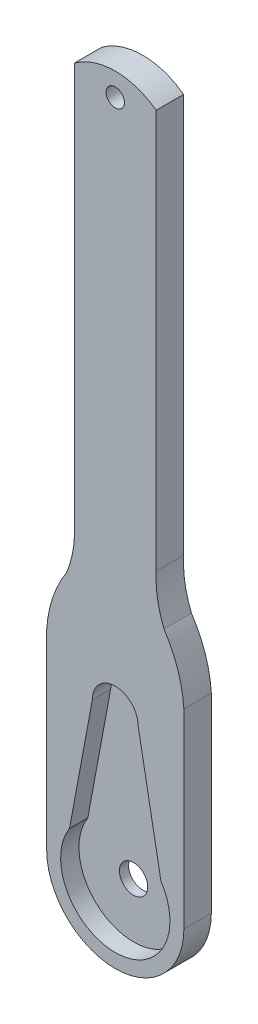
ISO-10303-21;
HEADER;
FILE_DESCRIPTION(('STEP AP214'),'2;1');
FILE_NAME('part.step','',(''),(''),'','','');
FILE_SCHEMA(('AUTOMOTIVE_DESIGN { 1 0 10303 214 1 1 1 1 }'));
ENDSEC;
DATA;
#1=APPLICATION_CONTEXT('core data for automotive mechanical design processes');
#2=APPLICATION_PROTOCOL_DEFINITION('international standard','automotive_design',2000,#1);
#3=PRODUCT_CONTEXT('',#1,'mechanical');
#4=PRODUCT('Part','Part','',(#3));
#5=PRODUCT_RELATED_PRODUCT_CATEGORY('part','',(#4));
#6=PRODUCT_DEFINITION_FORMATION('','',#4);
#7=PRODUCT_DEFINITION_CONTEXT('part definition',#1,'design');
#8=PRODUCT_DEFINITION('design','',#6,#7);
#9=PRODUCT_DEFINITION_SHAPE('','',#8);
#10=(LENGTH_UNIT() NAMED_UNIT(*) SI_UNIT(.MILLI.,.METRE.));
#11=(NAMED_UNIT(*) PLANE_ANGLE_UNIT() SI_UNIT($,.RADIAN.));
#12=(NAMED_UNIT(*) SI_UNIT($,.STERADIAN.) SOLID_ANGLE_UNIT());
#13=UNCERTAINTY_MEASURE_WITH_UNIT(LENGTH_MEASURE(1.E-05),#10,'distance_accuracy_value','');
#14=(GEOMETRIC_REPRESENTATION_CONTEXT(3) GLOBAL_UNCERTAINTY_ASSIGNED_CONTEXT((#13)) GLOBAL_UNIT_ASSIGNED_CONTEXT((#10,
#11,#12)) REPRESENTATION_CONTEXT('',''));
#15=CARTESIAN_POINT('',(0.,0.,0.));
#16=DIRECTION('',(0.,0.,1.));
#17=DIRECTION('',(1.,0.,0.));
#18=AXIS2_PLACEMENT_3D('',#15,#16,#17);
#19=CARTESIAN_POINT('',(15.,0.,3.));
#20=DIRECTION('',(-1.,0.,0.));
#21=DIRECTION('',(0.,-1.,0.));
#22=AXIS2_PLACEMENT_3D('',#19,#20,#21);
#23=PLANE('',#22);
#24=DIRECTION('',(0.,0.,1.));
#25=VECTOR('',#24,1.);
#26=CARTESIAN_POINT('',(15.,28.3348661710146,0.));
#27=LINE('',#26,#25);
#28=CARTESIAN_POINT('',(15.,28.3348661710146,0.));
#29=VERTEX_POINT('',#28);
#30=CARTESIAN_POINT('',(15.,28.3348661710146,3.));
#31=VERTEX_POINT('',#30);
#32=EDGE_CURVE('E269',#29,#31,#27,.T.);
#33=ORIENTED_EDGE('',*,*,#32,.T.);
#34=DIRECTION('',(0.,1.,0.));
#35=VECTOR('',#34,1.);
#36=CARTESIAN_POINT('',(15.,0.,3.));
#37=LINE('',#36,#35);
#38=CARTESIAN_POINT('',(15.,7.5,3.));
#39=VERTEX_POINT('',#38);
#40=EDGE_CURVE('E211',#39,#31,#37,.T.);
#41=ORIENTED_EDGE('',*,*,#40,.F.);
#42=DIRECTION('',(0.,0.,-1.));
#43=VECTOR('',#42,1.);
#44=CARTESIAN_POINT('',(15.,7.5,3.));
#45=LINE('',#44,#43);
#46=CARTESIAN_POINT('',(15.,7.5,0.));
#47=VERTEX_POINT('',#46);
#48=EDGE_CURVE('E89',#39,#47,#45,.T.);
#49=ORIENTED_EDGE('',*,*,#48,.T.);
#50=DIRECTION('',(0.,1.,0.));
#51=VECTOR('',#50,1.);
#52=CARTESIAN_POINT('',(15.,0.,0.));
#53=LINE('',#52,#51);
#54=EDGE_CURVE('E226',#47,#29,#53,.T.);
#55=ORIENTED_EDGE('',*,*,#54,.T.);
#56=EDGE_LOOP('',(#33,#41,#49,#55));
#57=FACE_BOUND('',#56,.T.);
#58=ADVANCED_FACE('F80',(#57),#23,.F.);
#59=CARTESIAN_POINT('',(0.,0.,3.));
#60=DIRECTION('',(0.,0.,1.));
#61=DIRECTION('',(1.,0.,0.));
#62=AXIS2_PLACEMENT_3D('',#59,#60,#61);
#63=PLANE('',#62);
#64=CARTESIAN_POINT('',(7.5,82.5,3.));
#65=DIRECTION('',(0.,0.,1.));
#66=DIRECTION('',(1.,0.,0.));
#67=AXIS2_PLACEMENT_3D('',#64,#65,#66);
#68=CIRCLE('',#67,1.);
#69=CARTESIAN_POINT('',(8.5,82.5,3.));
#70=VERTEX_POINT('',#69);
#71=EDGE_CURVE('E194',#70,#70,#68,.T.);
#72=ORIENTED_EDGE('',*,*,#71,.F.);
#73=EDGE_LOOP('',(#72));
#74=FACE_BOUND('',#73,.T.);
#75=CARTESIAN_POINT('',(13.1665917921247,27.5424330855072,3.));
#76=DIRECTION('',(0.,0.,1.));
#77=DIRECTION('',(1.,0.,0.));
#78=AXIS2_PLACEMENT_3D('',#75,#76,#77);
#79=CIRCLE('',#78,13.1904165823318);
#80=CARTESIAN_POINT('',(0.,28.3348661710144,3.));
#81=VERTEX_POINT('',#80);
#82=CARTESIAN_POINT('',(2.17384604862681,34.8326066523204,3.));
#83=VERTEX_POINT('',#82);
#84=EDGE_CURVE('E185',#81,#83,#79,.F.);
#85=ORIENTED_EDGE('',*,*,#84,.F.);
#86=DIRECTION('',(0.,1.,0.));
#87=VECTOR('',#86,1.);
#88=CARTESIAN_POINT('',(0.,0.,3.));
#89=LINE('',#88,#87);
#90=CARTESIAN_POINT('',(0.,7.5,3.));
#91=VERTEX_POINT('',#90);
#92=EDGE_CURVE('E201',#91,#81,#89,.T.);
#93=ORIENTED_EDGE('',*,*,#92,.F.);
#94=CARTESIAN_POINT('',(7.5,7.5,3.));
#95=DIRECTION('',(0.,0.,1.));
#96=DIRECTION('',(1.,0.,0.));
#97=AXIS2_PLACEMENT_3D('',#94,#95,#96);
#98=CIRCLE('',#97,7.5);
#99=EDGE_CURVE('E208',#91,#39,#98,.T.);
#100=ORIENTED_EDGE('',*,*,#99,.T.);
#101=ORIENTED_EDGE('',*,*,#40,.T.);
#102=CARTESIAN_POINT('',(1.8334082078753,27.5424330855072,3.));
#103=DIRECTION('',(0.,0.,1.));
#104=DIRECTION('',(1.,0.,0.));
#105=AXIS2_PLACEMENT_3D('',#102,#103,#104);
#106=CIRCLE('',#105,13.1904165823317);
#107=CARTESIAN_POINT('',(12.8261539513732,34.8326066523204,3.));
#108=VERTEX_POINT('',#107);
#109=EDGE_CURVE('E287',#31,#108,#106,.T.);
#110=ORIENTED_EDGE('',*,*,#109,.T.);
#111=CARTESIAN_POINT('',(23.6706458548375,39.2694901194657,3.));
#112=DIRECTION('',(0.,0.,1.));
#113=DIRECTION('',(1.,0.,0.));
#114=AXIS2_PLACEMENT_3D('',#111,#112,#113);
#115=CIRCLE('',#114,11.717036295298);
#116=CARTESIAN_POINT('',(11.9701182760311,39.8912568948095,3.));
#117=VERTEX_POINT('',#116);
#118=EDGE_CURVE('E278',#108,#117,#115,.F.);
#119=ORIENTED_EDGE('',*,*,#118,.T.);
#120=DIRECTION('',(0.,1.,0.));
#121=VECTOR('',#120,1.);
#122=CARTESIAN_POINT('',(11.9701182760311,0.,3.));
#123=LINE('',#122,#121);
#124=CARTESIAN_POINT('',(11.9701182760311,83.5222954592325,3.));
#125=VERTEX_POINT('',#124);
#126=EDGE_CURVE('E282',#117,#125,#123,.T.);
#127=ORIENTED_EDGE('',*,*,#126,.T.);
#128=CARTESIAN_POINT('',(7.5,77.5,3.));
#129=DIRECTION('',(0.,0.,1.));
#130=DIRECTION('',(1.,0.,0.));
#131=AXIS2_PLACEMENT_3D('',#128,#129,#130);
#132=CIRCLE('',#131,7.5);
#133=CARTESIAN_POINT('',(3.0298817239689,83.5222954592325,3.));
#134=VERTEX_POINT('',#133);
#135=EDGE_CURVE('E285',#125,#134,#132,.T.);
#136=ORIENTED_EDGE('',*,*,#135,.T.);
#137=DIRECTION('',(0.,1.,0.));
#138=VECTOR('',#137,1.);
#139=CARTESIAN_POINT('',(3.0298817239689,0.,3.));
#140=LINE('',#139,#138);
#141=CARTESIAN_POINT('',(3.0298817239689,39.8912568948095,3.));
#142=VERTEX_POINT('',#141);
#143=EDGE_CURVE('E301',#142,#134,#140,.T.);
#144=ORIENTED_EDGE('',*,*,#143,.F.);
#145=CARTESIAN_POINT('',(-8.67064585483752,39.2694901194657,3.));
#146=DIRECTION('',(0.,0.,1.));
#147=DIRECTION('',(1.,0.,0.));
#148=AXIS2_PLACEMENT_3D('',#145,#146,#147);
#149=CIRCLE('',#148,11.717036295298);
#150=EDGE_CURVE('E204',#83,#142,#149,.T.);
#151=ORIENTED_EDGE('',*,*,#150,.F.);
#152=EDGE_LOOP('',(#85,#93,#100,#101,#110,#119,#127,#136,#144,#151));
#153=FACE_BOUND('',#152,.T.);
#154=CARTESIAN_POINT('',(7.5,7.5,3.));
#155=DIRECTION('',(0.,0.,1.));
#156=DIRECTION('',(1.,0.,0.));
#157=AXIS2_PLACEMENT_3D('',#154,#155,#156);
#158=CIRCLE('',#157,5.975);
#159=CARTESIAN_POINT('',(2.49254210959306,10.759753131113,3.));
#160=VERTEX_POINT('',#159);
#161=CARTESIAN_POINT('',(12.4925421095931,10.7825520991966,3.));
#162=VERTEX_POINT('',#161);
#163=EDGE_CURVE('E229',#160,#162,#158,.T.);
#164=ORIENTED_EDGE('',*,*,#163,.F.);
#165=DIRECTION('',(-0.182741990740345,-0.983160904847348,0.));
#166=VECTOR('',#165,1.);
#167=CARTESIAN_POINT('',(0.476155885581611,-0.0885040017406163,3.));
#168=LINE('',#167,#166);
#169=CARTESIAN_POINT('',(5.,24.25,3.));
#170=VERTEX_POINT('',#169);
#171=EDGE_CURVE('E247',#170,#160,#168,.T.);
#172=ORIENTED_EDGE('',*,*,#171,.F.);
#173=CARTESIAN_POINT('',(7.5,24.25,3.));
#174=DIRECTION('',(0.,0.,1.));
#175=DIRECTION('',(1.,0.,0.));
#176=AXIS2_PLACEMENT_3D('',#173,#174,#175);
#177=CIRCLE('',#176,2.5);
#178=CARTESIAN_POINT('',(10.,24.25,3.));
#179=VERTEX_POINT('',#178);
#180=EDGE_CURVE('E213',#179,#170,#177,.T.);
#181=ORIENTED_EDGE('',*,*,#180,.F.);
#182=DIRECTION('',(0.181988331750918,-0.983300690077312,0.));
#183=VECTOR('',#182,1.);
#184=CARTESIAN_POINT('',(14.0083218368351,2.59264652963391,3.));
#185=LINE('',#184,#183);
#186=EDGE_CURVE('E209',#179,#162,#185,.T.);
#187=ORIENTED_EDGE('',*,*,#186,.T.);
#188=EDGE_LOOP('',(#164,#172,#181,#187));
#189=FACE_BOUND('',#188,.T.);
#190=ADVANCED_FACE('F198',(#74,#153,#189),#63,.T.);
#191=CARTESIAN_POINT('',(0.,0.,0.));
#192=DIRECTION('',(0.,0.,1.));
#193=DIRECTION('',(1.,0.,0.));
#194=AXIS2_PLACEMENT_3D('',#191,#192,#193);
#195=PLANE('',#194);
#196=CARTESIAN_POINT('',(7.5,82.5,0.));
#197=DIRECTION('',(0.,0.,1.));
#198=DIRECTION('',(1.,0.,0.));
#199=AXIS2_PLACEMENT_3D('',#196,#197,#198);
#200=CIRCLE('',#199,1.);
#201=CARTESIAN_POINT('',(8.5,82.5,0.));
#202=VERTEX_POINT('',#201);
#203=EDGE_CURVE('E299',#202,#202,#200,.T.);
#204=ORIENTED_EDGE('',*,*,#203,.T.);
#205=EDGE_LOOP('',(#204));
#206=FACE_BOUND('',#205,.T.);
#207=CARTESIAN_POINT('',(7.5,7.5,0.));
#208=DIRECTION('',(0.,0.,1.));
#209=DIRECTION('',(1.,0.,0.));
#210=AXIS2_PLACEMENT_3D('',#207,#208,#209);
#211=CIRCLE('',#210,1.55);
#212=CARTESIAN_POINT('',(9.05,7.5,0.));
#213=VERTEX_POINT('',#212);
#214=EDGE_CURVE('E296',#213,#213,#211,.T.);
#215=ORIENTED_EDGE('',*,*,#214,.T.);
#216=EDGE_LOOP('',(#215));
#217=FACE_BOUND('',#216,.T.);
#218=DIRECTION('',(0.,1.,0.));
#219=VECTOR('',#218,1.);
#220=CARTESIAN_POINT('',(0.,0.,0.));
#221=LINE('',#220,#219);
#222=CARTESIAN_POINT('',(0.,7.5,0.));
#223=VERTEX_POINT('',#222);
#224=CARTESIAN_POINT('',(0.,28.3348661710144,0.));
#225=VERTEX_POINT('',#224);
#226=EDGE_CURVE('E220',#223,#225,#221,.T.);
#227=ORIENTED_EDGE('',*,*,#226,.T.);
#228=CARTESIAN_POINT('',(13.1665917921247,27.5424330855072,0.));
#229=DIRECTION('',(0.,0.,1.));
#230=DIRECTION('',(1.,0.,0.));
#231=AXIS2_PLACEMENT_3D('',#228,#229,#230);
#232=CIRCLE('',#231,13.1904165823318);
#233=CARTESIAN_POINT('',(2.17384604862681,34.8326066523204,0.));
#234=VERTEX_POINT('',#233);
#235=EDGE_CURVE('E188',#225,#234,#232,.F.);
#236=ORIENTED_EDGE('',*,*,#235,.T.);
#237=CARTESIAN_POINT('',(-8.67064585483752,39.2694901194657,0.));
#238=DIRECTION('',(0.,0.,1.));
#239=DIRECTION('',(1.,0.,0.));
#240=AXIS2_PLACEMENT_3D('',#237,#238,#239);
#241=CIRCLE('',#240,11.717036295298);
#242=CARTESIAN_POINT('',(3.0298817239689,39.8912568948095,0.));
#243=VERTEX_POINT('',#242);
#244=EDGE_CURVE('E302',#234,#243,#241,.T.);
#245=ORIENTED_EDGE('',*,*,#244,.T.);
#246=DIRECTION('',(0.,1.,0.));
#247=VECTOR('',#246,1.);
#248=CARTESIAN_POINT('',(3.0298817239689,0.,0.));
#249=LINE('',#248,#247);
#250=CARTESIAN_POINT('',(3.0298817239689,83.5222954592325,0.));
#251=VERTEX_POINT('',#250);
#252=EDGE_CURVE('E305',#243,#251,#249,.T.);
#253=ORIENTED_EDGE('',*,*,#252,.T.);
#254=CARTESIAN_POINT('',(7.5,77.5,0.));
#255=DIRECTION('',(0.,0.,1.));
#256=DIRECTION('',(1.,0.,0.));
#257=AXIS2_PLACEMENT_3D('',#254,#255,#256);
#258=CIRCLE('',#257,7.5);
#259=CARTESIAN_POINT('',(11.9701182760311,83.5222954592325,0.));
#260=VERTEX_POINT('',#259);
#261=EDGE_CURVE('E293',#260,#251,#258,.T.);
#262=ORIENTED_EDGE('',*,*,#261,.F.);
#263=DIRECTION('',(0.,1.,0.));
#264=VECTOR('',#263,1.);
#265=CARTESIAN_POINT('',(11.9701182760311,0.,0.));
#266=LINE('',#265,#264);
#267=CARTESIAN_POINT('',(11.9701182760311,39.8912568948095,0.));
#268=VERTEX_POINT('',#267);
#269=EDGE_CURVE('E291',#268,#260,#266,.T.);
#270=ORIENTED_EDGE('',*,*,#269,.F.);
#271=CARTESIAN_POINT('',(23.6706458548375,39.2694901194657,0.));
#272=DIRECTION('',(0.,0.,1.));
#273=DIRECTION('',(1.,0.,0.));
#274=AXIS2_PLACEMENT_3D('',#271,#272,#273);
#275=CIRCLE('',#274,11.717036295298);
#276=CARTESIAN_POINT('',(12.8261539513732,34.8326066523204,0.));
#277=VERTEX_POINT('',#276);
#278=EDGE_CURVE('E272',#277,#268,#275,.F.);
#279=ORIENTED_EDGE('',*,*,#278,.F.);
#280=CARTESIAN_POINT('',(1.8334082078753,27.5424330855072,0.));
#281=DIRECTION('',(0.,0.,1.));
#282=DIRECTION('',(1.,0.,0.));
#283=AXIS2_PLACEMENT_3D('',#280,#281,#282);
#284=CIRCLE('',#283,13.1904165823317);
#285=EDGE_CURVE('E281',#29,#277,#284,.T.);
#286=ORIENTED_EDGE('',*,*,#285,.F.);
#287=ORIENTED_EDGE('',*,*,#54,.F.);
#288=CARTESIAN_POINT('',(7.5,7.5,0.));
#289=DIRECTION('',(0.,0.,1.));
#290=DIRECTION('',(1.,0.,0.));
#291=AXIS2_PLACEMENT_3D('',#288,#289,#290);
#292=CIRCLE('',#291,7.5);
#293=EDGE_CURVE('E222',#223,#47,#292,.T.);
#294=ORIENTED_EDGE('',*,*,#293,.F.);
#295=EDGE_LOOP('',(#227,#236,#245,#253,#262,#270,#279,#286,#287,#294));
#296=FACE_BOUND('',#295,.T.);
#297=ADVANCED_FACE('F325',(#206,#217,#296),#195,.F.);
#298=CARTESIAN_POINT('',(0.,0.,3.));
#299=DIRECTION('',(-1.,0.,0.));
#300=DIRECTION('',(0.,0.,1.));
#301=AXIS2_PLACEMENT_3D('',#298,#299,#300);
#302=PLANE('',#301);
#303=DIRECTION('',(0.,0.,1.));
#304=VECTOR('',#303,1.);
#305=CARTESIAN_POINT('',(0.,28.3348661710144,0.));
#306=LINE('',#305,#304);
#307=EDGE_CURVE('E182',#225,#81,#306,.T.);
#308=ORIENTED_EDGE('',*,*,#307,.F.);
#309=ORIENTED_EDGE('',*,*,#226,.F.);
#310=DIRECTION('',(0.,0.,-1.));
#311=VECTOR('',#310,1.);
#312=CARTESIAN_POINT('',(0.,7.5,3.));
#313=LINE('',#312,#311);
#314=EDGE_CURVE('E12',#91,#223,#313,.T.);
#315=ORIENTED_EDGE('',*,*,#314,.F.);
#316=ORIENTED_EDGE('',*,*,#92,.T.);
#317=EDGE_LOOP('',(#308,#309,#315,#316));
#318=FACE_BOUND('',#317,.T.);
#319=ADVANCED_FACE('F206',(#318),#302,.T.);
#320=CARTESIAN_POINT('',(7.5,7.5,3.));
#321=DIRECTION('',(0.,0.,-1.));
#322=DIRECTION('',(-1.,0.,0.));
#323=AXIS2_PLACEMENT_3D('',#320,#321,#322);
#324=CYLINDRICAL_SURFACE('',#323,7.5);
#325=ORIENTED_EDGE('',*,*,#293,.T.);
#326=ORIENTED_EDGE('',*,*,#48,.F.);
#327=ORIENTED_EDGE('',*,*,#99,.F.);
#328=ORIENTED_EDGE('',*,*,#314,.T.);
#329=EDGE_LOOP('',(#325,#326,#327,#328));
#330=FACE_BOUND('',#329,.T.);
#331=ADVANCED_FACE('F339',(#330),#324,.T.);
#332=CARTESIAN_POINT('',(7.5,7.5,3.));
#333=DIRECTION('',(0.,0.,-1.));
#334=DIRECTION('',(-1.,0.,0.));
#335=AXIS2_PLACEMENT_3D('',#332,#333,#334);
#336=CYLINDRICAL_SURFACE('',#335,5.975);
#337=CARTESIAN_POINT('',(7.5,7.5,1.));
#338=DIRECTION('',(0.,0.,1.));
#339=DIRECTION('',(1.,0.,0.));
#340=AXIS2_PLACEMENT_3D('',#337,#338,#339);
#341=CIRCLE('',#340,5.975);
#342=CARTESIAN_POINT('',(2.49254210959306,10.759753131113,1.));
#343=VERTEX_POINT('',#342);
#344=CARTESIAN_POINT('',(12.4925421095931,10.7825520991966,1.));
#345=VERTEX_POINT('',#344);
#346=EDGE_CURVE('E105',#343,#345,#341,.T.);
#347=ORIENTED_EDGE('',*,*,#346,.F.);
#348=DIRECTION('',(0.,0.,-1.));
#349=VECTOR('',#348,1.);
#350=CARTESIAN_POINT('',(2.49254210959306,10.759753131113,3.));
#351=LINE('',#350,#349);
#352=EDGE_CURVE('E231',#160,#343,#351,.T.);
#353=ORIENTED_EDGE('',*,*,#352,.F.);
#354=ORIENTED_EDGE('',*,*,#163,.T.);
#355=DIRECTION('',(0.,0.,-1.));
#356=VECTOR('',#355,1.);
#357=CARTESIAN_POINT('',(12.4925421095931,10.7825520991966,3.));
#358=LINE('',#357,#356);
#359=EDGE_CURVE('E219',#162,#345,#358,.T.);
#360=ORIENTED_EDGE('',*,*,#359,.T.);
#361=EDGE_LOOP('',(#347,#353,#354,#360));
#362=FACE_BOUND('',#361,.T.);
#363=ADVANCED_FACE('F82',(#362),#336,.F.);
#364=CARTESIAN_POINT('',(0.476155885581611,-0.0885040017406163,3.));
#365=DIRECTION('',(0.983160904847348,-0.182741990740345,0.));
#366=DIRECTION('',(0.182741990740345,0.983160904847348,0.));
#367=AXIS2_PLACEMENT_3D('',#364,#365,#366);
#368=PLANE('',#367);
#369=DIRECTION('',(-0.182741990740345,-0.983160904847348,0.));
#370=VECTOR('',#369,1.);
#371=CARTESIAN_POINT('',(0.476155885581611,-0.0885040017406163,1.));
#372=LINE('',#371,#370);
#373=CARTESIAN_POINT('',(5.,24.25,1.));
#374=VERTEX_POINT('',#373);
#375=EDGE_CURVE('E245',#374,#343,#372,.T.);
#376=ORIENTED_EDGE('',*,*,#375,.F.);
#377=DIRECTION('',(0.,0.,-1.));
#378=VECTOR('',#377,1.);
#379=CARTESIAN_POINT('',(5.,24.25,3.));
#380=LINE('',#379,#378);
#381=EDGE_CURVE('E238',#170,#374,#380,.T.);
#382=ORIENTED_EDGE('',*,*,#381,.F.);
#383=ORIENTED_EDGE('',*,*,#171,.T.);
#384=ORIENTED_EDGE('',*,*,#352,.T.);
#385=EDGE_LOOP('',(#376,#382,#383,#384));
#386=FACE_BOUND('',#385,.T.);
#387=ADVANCED_FACE('F244',(#386),#368,.T.);
#388=CARTESIAN_POINT('',(7.5,24.25,3.));
#389=DIRECTION('',(0.,0.,-1.));
#390=DIRECTION('',(-1.,0.,0.));
#391=AXIS2_PLACEMENT_3D('',#388,#389,#390);
#392=CYLINDRICAL_SURFACE('',#391,2.5);
#393=CARTESIAN_POINT('',(7.5,24.25,1.));
#394=DIRECTION('',(0.,0.,1.));
#395=DIRECTION('',(1.,0.,0.));
#396=AXIS2_PLACEMENT_3D('',#393,#394,#395);
#397=CIRCLE('',#396,2.5);
#398=CARTESIAN_POINT('',(10.,24.25,1.));
#399=VERTEX_POINT('',#398);
#400=EDGE_CURVE('E262',#399,#374,#397,.T.);
#401=ORIENTED_EDGE('',*,*,#400,.F.);
#402=DIRECTION('',(0.,0.,-1.));
#403=VECTOR('',#402,1.);
#404=CARTESIAN_POINT('',(10.,24.25,3.));
#405=LINE('',#404,#403);
#406=EDGE_CURVE('E235',#179,#399,#405,.T.);
#407=ORIENTED_EDGE('',*,*,#406,.F.);
#408=ORIENTED_EDGE('',*,*,#180,.T.);
#409=ORIENTED_EDGE('',*,*,#381,.T.);
#410=EDGE_LOOP('',(#401,#407,#408,#409));
#411=FACE_BOUND('',#410,.T.);
#412=ADVANCED_FACE('F261',(#411),#392,.F.);
#413=CARTESIAN_POINT('',(14.0083218368351,2.59264652963391,3.));
#414=DIRECTION('',(0.983300690077312,0.181988331750918,0.));
#415=DIRECTION('',(-0.181988331750918,0.983300690077312,0.));
#416=AXIS2_PLACEMENT_3D('',#413,#414,#415);
#417=PLANE('',#416);
#418=ORIENTED_EDGE('',*,*,#406,.T.);
#419=DIRECTION('',(0.181988331750918,-0.983300690077312,0.));
#420=VECTOR('',#419,1.);
#421=CARTESIAN_POINT('',(14.0083218368351,2.59264652963391,1.));
#422=LINE('',#421,#420);
#423=EDGE_CURVE('E223',#399,#345,#422,.T.);
#424=ORIENTED_EDGE('',*,*,#423,.T.);
#425=ORIENTED_EDGE('',*,*,#359,.F.);
#426=ORIENTED_EDGE('',*,*,#186,.F.);
#427=EDGE_LOOP('',(#418,#424,#425,#426));
#428=FACE_BOUND('',#427,.T.);
#429=ADVANCED_FACE('F264',(#428),#417,.F.);
#430=CARTESIAN_POINT('',(0.,0.,1.));
#431=DIRECTION('',(0.,0.,1.));
#432=DIRECTION('',(1.,0.,0.));
#433=AXIS2_PLACEMENT_3D('',#430,#431,#432);
#434=PLANE('',#433);
#435=CARTESIAN_POINT('',(7.5,7.5,1.));
#436=DIRECTION('',(0.,0.,1.));
#437=DIRECTION('',(1.,0.,0.));
#438=AXIS2_PLACEMENT_3D('',#435,#436,#437);
#439=CIRCLE('',#438,1.55);
#440=CARTESIAN_POINT('',(9.05,7.5,1.));
#441=VERTEX_POINT('',#440);
#442=EDGE_CURVE('E84',#441,#441,#439,.T.);
#443=ORIENTED_EDGE('',*,*,#442,.F.);
#444=EDGE_LOOP('',(#443));
#445=FACE_BOUND('',#444,.T.);
#446=ORIENTED_EDGE('',*,*,#400,.T.);
#447=ORIENTED_EDGE('',*,*,#375,.T.);
#448=ORIENTED_EDGE('',*,*,#346,.T.);
#449=ORIENTED_EDGE('',*,*,#423,.F.);
#450=EDGE_LOOP('',(#446,#447,#448,#449));
#451=FACE_BOUND('',#450,.T.);
#452=ADVANCED_FACE('F336',(#445,#451),#434,.T.);
#453=CARTESIAN_POINT('',(1.8334082078753,27.5424330855072,0.));
#454=DIRECTION('',(0.,0.,1.));
#455=DIRECTION('',(1.,0.,0.));
#456=AXIS2_PLACEMENT_3D('',#453,#454,#455);
#457=CYLINDRICAL_SURFACE('',#456,13.1904165823317);
#458=ORIENTED_EDGE('',*,*,#109,.F.);
#459=ORIENTED_EDGE('',*,*,#32,.F.);
#460=ORIENTED_EDGE('',*,*,#285,.T.);
#461=DIRECTION('',(0.,0.,1.));
#462=VECTOR('',#461,1.);
#463=CARTESIAN_POINT('',(12.8261539513732,34.8326066523204,0.));
#464=LINE('',#463,#462);
#465=EDGE_CURVE('E268',#277,#108,#464,.T.);
#466=ORIENTED_EDGE('',*,*,#465,.T.);
#467=EDGE_LOOP('',(#458,#459,#460,#466));
#468=FACE_BOUND('',#467,.T.);
#469=ADVANCED_FACE('F409',(#468),#457,.T.);
#470=CARTESIAN_POINT('',(23.6706458548375,39.2694901194657,0.));
#471=DIRECTION('',(0.,0.,1.));
#472=DIRECTION('',(1.,0.,0.));
#473=AXIS2_PLACEMENT_3D('',#470,#471,#472);
#474=CYLINDRICAL_SURFACE('',#473,11.717036295298);
#475=ORIENTED_EDGE('',*,*,#118,.F.);
#476=ORIENTED_EDGE('',*,*,#465,.F.);
#477=ORIENTED_EDGE('',*,*,#278,.T.);
#478=DIRECTION('',(0.,0.,1.));
#479=VECTOR('',#478,1.);
#480=CARTESIAN_POINT('',(11.9701182760311,39.8912568948095,0.));
#481=LINE('',#480,#479);
#482=EDGE_CURVE('E274',#268,#117,#481,.T.);
#483=ORIENTED_EDGE('',*,*,#482,.T.);
#484=EDGE_LOOP('',(#475,#476,#477,#483));
#485=FACE_BOUND('',#484,.T.);
#486=ADVANCED_FACE('F416',(#485),#474,.F.);
#487=CARTESIAN_POINT('',(11.9701182760311,0.,0.));
#488=DIRECTION('',(1.,0.,0.));
#489=DIRECTION('',(0.,1.,0.));
#490=AXIS2_PLACEMENT_3D('',#487,#488,#489);
#491=PLANE('',#490);
#492=ORIENTED_EDGE('',*,*,#126,.F.);
#493=ORIENTED_EDGE('',*,*,#482,.F.);
#494=ORIENTED_EDGE('',*,*,#269,.T.);
#495=DIRECTION('',(0.,0.,1.));
#496=VECTOR('',#495,1.);
#497=CARTESIAN_POINT('',(11.9701182760311,83.5222954592325,0.));
#498=LINE('',#497,#496);
#499=EDGE_CURVE('E97',#260,#125,#498,.T.);
#500=ORIENTED_EDGE('',*,*,#499,.T.);
#501=EDGE_LOOP('',(#492,#493,#494,#500));
#502=FACE_BOUND('',#501,.T.);
#503=ADVANCED_FACE('F422',(#502),#491,.T.);
#504=CARTESIAN_POINT('',(7.5,77.5,0.));
#505=DIRECTION('',(0.,0.,1.));
#506=DIRECTION('',(1.,0.,0.));
#507=AXIS2_PLACEMENT_3D('',#504,#505,#506);
#508=CYLINDRICAL_SURFACE('',#507,7.5);
#509=ORIENTED_EDGE('',*,*,#135,.F.);
#510=ORIENTED_EDGE('',*,*,#499,.F.);
#511=ORIENTED_EDGE('',*,*,#261,.T.);
#512=DIRECTION('',(0.,0.,1.));
#513=VECTOR('',#512,1.);
#514=CARTESIAN_POINT('',(3.0298817239689,83.5222954592325,0.));
#515=LINE('',#514,#513);
#516=EDGE_CURVE('E193',#251,#134,#515,.T.);
#517=ORIENTED_EDGE('',*,*,#516,.T.);
#518=EDGE_LOOP('',(#509,#510,#511,#517));
#519=FACE_BOUND('',#518,.T.);
#520=ADVANCED_FACE('F411',(#519),#508,.T.);
#521=CARTESIAN_POINT('',(13.1665917921247,27.5424330855072,0.));
#522=DIRECTION('',(0.,0.,1.));
#523=DIRECTION('',(1.,0.,0.));
#524=AXIS2_PLACEMENT_3D('',#521,#522,#523);
#525=CYLINDRICAL_SURFACE('',#524,13.1904165823318);
#526=ORIENTED_EDGE('',*,*,#84,.T.);
#527=DIRECTION('',(0.,0.,1.));
#528=VECTOR('',#527,1.);
#529=CARTESIAN_POINT('',(2.17384604862681,34.8326066523204,0.));
#530=LINE('',#529,#528);
#531=EDGE_CURVE('E307',#234,#83,#530,.T.);
#532=ORIENTED_EDGE('',*,*,#531,.F.);
#533=ORIENTED_EDGE('',*,*,#235,.F.);
#534=ORIENTED_EDGE('',*,*,#307,.T.);
#535=EDGE_LOOP('',(#526,#532,#533,#534));
#536=FACE_BOUND('',#535,.T.);
#537=ADVANCED_FACE('F184',(#536),#525,.T.);
#538=CARTESIAN_POINT('',(3.0298817239689,0.,0.));
#539=DIRECTION('',(1.,0.,0.));
#540=DIRECTION('',(0.,0.,-1.));
#541=AXIS2_PLACEMENT_3D('',#538,#539,#540);
#542=PLANE('',#541);
#543=ORIENTED_EDGE('',*,*,#143,.T.);
#544=ORIENTED_EDGE('',*,*,#516,.F.);
#545=ORIENTED_EDGE('',*,*,#252,.F.);
#546=DIRECTION('',(0.,0.,1.));
#547=VECTOR('',#546,1.);
#548=CARTESIAN_POINT('',(3.0298817239689,39.8912568948095,0.));
#549=LINE('',#548,#547);
#550=EDGE_CURVE('E314',#243,#142,#549,.T.);
#551=ORIENTED_EDGE('',*,*,#550,.T.);
#552=EDGE_LOOP('',(#543,#544,#545,#551));
#553=FACE_BOUND('',#552,.T.);
#554=ADVANCED_FACE('F443',(#553),#542,.F.);
#555=CARTESIAN_POINT('',(-8.67064585483752,39.2694901194657,0.));
#556=DIRECTION('',(0.,0.,1.));
#557=DIRECTION('',(1.,0.,0.));
#558=AXIS2_PLACEMENT_3D('',#555,#556,#557);
#559=CYLINDRICAL_SURFACE('',#558,11.717036295298);
#560=ORIENTED_EDGE('',*,*,#150,.T.);
#561=ORIENTED_EDGE('',*,*,#550,.F.);
#562=ORIENTED_EDGE('',*,*,#244,.F.);
#563=ORIENTED_EDGE('',*,*,#531,.T.);
#564=EDGE_LOOP('',(#560,#561,#562,#563));
#565=FACE_BOUND('',#564,.T.);
#566=ADVANCED_FACE('F450',(#565),#559,.F.);
#567=CARTESIAN_POINT('',(7.5,7.5,0.));
#568=DIRECTION('',(0.,0.,1.));
#569=DIRECTION('',(1.,0.,0.));
#570=AXIS2_PLACEMENT_3D('',#567,#568,#569);
#571=CYLINDRICAL_SURFACE('',#570,1.55);
#572=ORIENTED_EDGE('',*,*,#442,.T.);
#573=EDGE_LOOP('',(#572));
#574=FACE_BOUND('',#573,.T.);
#575=ORIENTED_EDGE('',*,*,#214,.F.);
#576=EDGE_LOOP('',(#575));
#577=FACE_BOUND('',#576,.T.);
#578=ADVANCED_FACE('F458',(#574,#577),#571,.F.);
#579=CARTESIAN_POINT('',(7.5,82.5,0.));
#580=DIRECTION('',(0.,0.,1.));
#581=DIRECTION('',(1.,0.,0.));
#582=AXIS2_PLACEMENT_3D('',#579,#580,#581);
#583=CYLINDRICAL_SURFACE('',#582,1.);
#584=ORIENTED_EDGE('',*,*,#203,.F.);
#585=EDGE_LOOP('',(#584));
#586=FACE_BOUND('',#585,.T.);
#587=ORIENTED_EDGE('',*,*,#71,.T.);
#588=EDGE_LOOP('',(#587));
#589=FACE_BOUND('',#588,.T.);
#590=ADVANCED_FACE('F322',(#586,#589),#583,.F.);
#591=CLOSED_SHELL('',(#58,#190,#297,#319,#331,#363,#387,#412,#429,#452,#469,#486,#503,#520,#537,
#554,#566,#578,#590));
#592=MANIFOLD_SOLID_BREP('B2',#591);
#593=ADVANCED_BREP_SHAPE_REPRESENTATION('',(#18,#592),#14);
#594=SHAPE_DEFINITION_REPRESENTATION(#9,#593);
ENDSEC;
END-ISO-10303-21;
